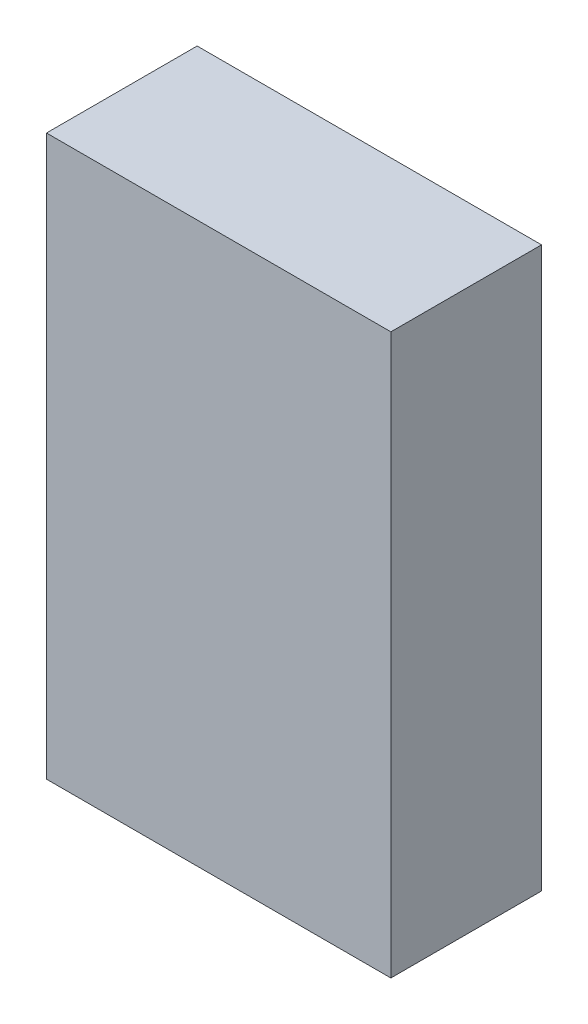
ISO-10303-21;
HEADER;
FILE_DESCRIPTION(('STEP AP214'),'2;1');
FILE_NAME('part.step','',(''),(''),'','','');
FILE_SCHEMA(('AUTOMOTIVE_DESIGN { 1 0 10303 214 1 1 1 1 }'));
ENDSEC;
DATA;
#1=APPLICATION_CONTEXT('core data for automotive mechanical design processes');
#2=APPLICATION_PROTOCOL_DEFINITION('international standard','automotive_design',2000,#1);
#3=PRODUCT_CONTEXT('',#1,'mechanical');
#4=PRODUCT('Part','Part','',(#3));
#5=PRODUCT_RELATED_PRODUCT_CATEGORY('part','',(#4));
#6=PRODUCT_DEFINITION_FORMATION('','',#4);
#7=PRODUCT_DEFINITION_CONTEXT('part definition',#1,'design');
#8=PRODUCT_DEFINITION('design','',#6,#7);
#9=PRODUCT_DEFINITION_SHAPE('','',#8);
#10=(LENGTH_UNIT() NAMED_UNIT(*) SI_UNIT(.MILLI.,.METRE.));
#11=(NAMED_UNIT(*) PLANE_ANGLE_UNIT() SI_UNIT($,.RADIAN.));
#12=(NAMED_UNIT(*) SI_UNIT($,.STERADIAN.) SOLID_ANGLE_UNIT());
#13=UNCERTAINTY_MEASURE_WITH_UNIT(LENGTH_MEASURE(1.E-05),#10,'distance_accuracy_value','');
#14=(GEOMETRIC_REPRESENTATION_CONTEXT(3) GLOBAL_UNCERTAINTY_ASSIGNED_CONTEXT((#13)) GLOBAL_UNIT_ASSIGNED_CONTEXT((#10,
#11,#12)) REPRESENTATION_CONTEXT('',''));
#15=CARTESIAN_POINT('',(0.,0.,0.));
#16=DIRECTION('',(0.,0.,1.));
#17=DIRECTION('',(1.,0.,0.));
#18=AXIS2_PLACEMENT_3D('',#15,#16,#17);
#19=CARTESIAN_POINT('',(0.,0.,0.));
#20=DIRECTION('',(0.,0.,-1.));
#21=DIRECTION('',(-1.,0.,0.));
#22=AXIS2_PLACEMENT_3D('',#19,#20,#21);
#23=PLANE('',#22);
#24=DIRECTION('',(0.,-1.,0.));
#25=VECTOR('',#24,1.);
#26=CARTESIAN_POINT('',(0.,0.,0.));
#27=LINE('',#26,#25);
#28=CARTESIAN_POINT('',(0.,26.,0.));
#29=VERTEX_POINT('',#28);
#30=CARTESIAN_POINT('',(0.,0.,0.));
#31=VERTEX_POINT('',#30);
#32=EDGE_CURVE('E104',#29,#31,#27,.T.);
#33=ORIENTED_EDGE('',*,*,#32,.F.);
#34=DIRECTION('',(-1.,0.,0.));
#35=VECTOR('',#34,1.);
#36=CARTESIAN_POINT('',(0.,26.,0.));
#37=LINE('',#36,#35);
#38=CARTESIAN_POINT('',(16.,26.,0.));
#39=VERTEX_POINT('',#38);
#40=EDGE_CURVE('E55',#39,#29,#37,.T.);
#41=ORIENTED_EDGE('',*,*,#40,.F.);
#42=DIRECTION('',(0.,1.,0.));
#43=VECTOR('',#42,1.);
#44=CARTESIAN_POINT('',(16.,0.,0.));
#45=LINE('',#44,#43);
#46=CARTESIAN_POINT('',(16.,0.,0.));
#47=VERTEX_POINT('',#46);
#48=EDGE_CURVE('E161',#47,#39,#45,.T.);
#49=ORIENTED_EDGE('',*,*,#48,.F.);
#50=DIRECTION('',(1.,0.,0.));
#51=VECTOR('',#50,1.);
#52=CARTESIAN_POINT('',(0.,0.,0.));
#53=LINE('',#52,#51);
#54=EDGE_CURVE('E159',#31,#47,#53,.T.);
#55=ORIENTED_EDGE('',*,*,#54,.F.);
#56=EDGE_LOOP('',(#33,#41,#49,#55));
#57=FACE_BOUND('',#56,.T.);
#58=DIRECTION('',(0.,1.,0.));
#59=VECTOR('',#58,1.);
#60=CARTESIAN_POINT('',(13.25,23.7906209274536,0.));
#61=LINE('',#60,#59);
#62=CARTESIAN_POINT('',(13.25,2.2093790725464,0.));
#63=VERTEX_POINT('',#62);
#64=CARTESIAN_POINT('',(13.25,23.7906209274536,0.));
#65=VERTEX_POINT('',#64);
#66=EDGE_CURVE('E132',#63,#65,#61,.T.);
#67=ORIENTED_EDGE('',*,*,#66,.T.);
#68=CARTESIAN_POINT('',(8.,13.,0.));
#69=DIRECTION('',(0.,0.,1.));
#70=DIRECTION('',(1.,0.,0.));
#71=AXIS2_PLACEMENT_3D('',#68,#69,#70);
#72=CIRCLE('',#71,12.);
#73=CARTESIAN_POINT('',(2.75,23.7906209274536,0.));
#74=VERTEX_POINT('',#73);
#75=EDGE_CURVE('E47',#65,#74,#72,.T.);
#76=ORIENTED_EDGE('',*,*,#75,.T.);
#77=DIRECTION('',(0.,-1.,0.));
#78=VECTOR('',#77,1.);
#79=CARTESIAN_POINT('',(2.75,23.7906209274536,0.));
#80=LINE('',#79,#78);
#81=CARTESIAN_POINT('',(2.75,2.20937907254641,0.));
#82=VERTEX_POINT('',#81);
#83=EDGE_CURVE('E143',#74,#82,#80,.T.);
#84=ORIENTED_EDGE('',*,*,#83,.T.);
#85=CARTESIAN_POINT('',(8.,13.,0.));
#86=DIRECTION('',(0.,0.,1.));
#87=DIRECTION('',(1.,0.,0.));
#88=AXIS2_PLACEMENT_3D('',#85,#86,#87);
#89=CIRCLE('',#88,12.);
#90=EDGE_CURVE('E146',#82,#63,#89,.T.);
#91=ORIENTED_EDGE('',*,*,#90,.T.);
#92=EDGE_LOOP('',(#67,#76,#84,#91));
#93=FACE_BOUND('',#92,.T.);
#94=ADVANCED_FACE('F32',(#57,#93),#23,.T.);
#95=CARTESIAN_POINT('',(0.,0.,3.5));
#96=DIRECTION('',(1.,0.,0.));
#97=DIRECTION('',(0.,0.,-1.));
#98=AXIS2_PLACEMENT_3D('',#95,#96,#97);
#99=PLANE('',#98);
#100=ORIENTED_EDGE('',*,*,#32,.T.);
#101=DIRECTION('',(0.,0.,-1.));
#102=VECTOR('',#101,1.);
#103=CARTESIAN_POINT('',(0.,0.,3.5));
#104=LINE('',#103,#102);
#105=CARTESIAN_POINT('',(0.,0.,7.));
#106=VERTEX_POINT('',#105);
#107=EDGE_CURVE('E11',#106,#31,#104,.T.);
#108=ORIENTED_EDGE('',*,*,#107,.F.);
#109=DIRECTION('',(0.,-1.,0.));
#110=VECTOR('',#109,1.);
#111=CARTESIAN_POINT('',(0.,26.,7.));
#112=LINE('',#111,#110);
#113=CARTESIAN_POINT('',(0.,26.,7.));
#114=VERTEX_POINT('',#113);
#115=EDGE_CURVE('E102',#114,#106,#112,.T.);
#116=ORIENTED_EDGE('',*,*,#115,.F.);
#117=DIRECTION('',(0.,0.,-1.));
#118=VECTOR('',#117,1.);
#119=CARTESIAN_POINT('',(0.,26.,3.5));
#120=LINE('',#119,#118);
#121=EDGE_CURVE('E164',#114,#29,#120,.T.);
#122=ORIENTED_EDGE('',*,*,#121,.T.);
#123=EDGE_LOOP('',(#100,#108,#116,#122));
#124=FACE_BOUND('',#123,.T.);
#125=ADVANCED_FACE('F34',(#124),#99,.F.);
#126=CARTESIAN_POINT('',(0.,0.,3.5));
#127=DIRECTION('',(0.,1.,0.));
#128=DIRECTION('',(-1.,0.,0.));
#129=AXIS2_PLACEMENT_3D('',#126,#127,#128);
#130=PLANE('',#129);
#131=ORIENTED_EDGE('',*,*,#54,.T.);
#132=DIRECTION('',(0.,0.,-1.));
#133=VECTOR('',#132,1.);
#134=CARTESIAN_POINT('',(16.,0.,3.5));
#135=LINE('',#134,#133);
#136=CARTESIAN_POINT('',(16.,0.,7.));
#137=VERTEX_POINT('',#136);
#138=EDGE_CURVE('E40',#137,#47,#135,.T.);
#139=ORIENTED_EDGE('',*,*,#138,.F.);
#140=DIRECTION('',(1.,0.,0.));
#141=VECTOR('',#140,1.);
#142=CARTESIAN_POINT('',(0.,0.,7.));
#143=LINE('',#142,#141);
#144=EDGE_CURVE('E107',#106,#137,#143,.T.);
#145=ORIENTED_EDGE('',*,*,#144,.F.);
#146=ORIENTED_EDGE('',*,*,#107,.T.);
#147=EDGE_LOOP('',(#131,#139,#145,#146));
#148=FACE_BOUND('',#147,.T.);
#149=ADVANCED_FACE('F108',(#148),#130,.F.);
#150=CARTESIAN_POINT('',(16.,0.,3.5));
#151=DIRECTION('',(-1.,0.,0.));
#152=DIRECTION('',(0.,0.,1.));
#153=AXIS2_PLACEMENT_3D('',#150,#151,#152);
#154=PLANE('',#153);
#155=ORIENTED_EDGE('',*,*,#48,.T.);
#156=DIRECTION('',(0.,0.,-1.));
#157=VECTOR('',#156,1.);
#158=CARTESIAN_POINT('',(16.,26.,3.5));
#159=LINE('',#158,#157);
#160=CARTESIAN_POINT('',(16.,26.,7.));
#161=VERTEX_POINT('',#160);
#162=EDGE_CURVE('E166',#161,#39,#159,.T.);
#163=ORIENTED_EDGE('',*,*,#162,.F.);
#164=DIRECTION('',(0.,1.,0.));
#165=VECTOR('',#164,1.);
#166=CARTESIAN_POINT('',(16.,26.,7.));
#167=LINE('',#166,#165);
#168=EDGE_CURVE('E113',#137,#161,#167,.T.);
#169=ORIENTED_EDGE('',*,*,#168,.F.);
#170=ORIENTED_EDGE('',*,*,#138,.T.);
#171=EDGE_LOOP('',(#155,#163,#169,#170));
#172=FACE_BOUND('',#171,.T.);
#173=ADVANCED_FACE('F169',(#172),#154,.F.);
#174=CARTESIAN_POINT('',(0.,26.,3.5));
#175=DIRECTION('',(0.,-1.,0.));
#176=DIRECTION('',(0.,0.,-1.));
#177=AXIS2_PLACEMENT_3D('',#174,#175,#176);
#178=PLANE('',#177);
#179=ORIENTED_EDGE('',*,*,#40,.T.);
#180=ORIENTED_EDGE('',*,*,#121,.F.);
#181=DIRECTION('',(-1.,0.,0.));
#182=VECTOR('',#181,1.);
#183=CARTESIAN_POINT('',(0.,26.,7.));
#184=LINE('',#183,#182);
#185=EDGE_CURVE('E118',#161,#114,#184,.T.);
#186=ORIENTED_EDGE('',*,*,#185,.F.);
#187=ORIENTED_EDGE('',*,*,#162,.T.);
#188=EDGE_LOOP('',(#179,#180,#186,#187));
#189=FACE_BOUND('',#188,.T.);
#190=ADVANCED_FACE('F206',(#189),#178,.F.);
#191=CARTESIAN_POINT('',(8.,13.,3.5));
#192=DIRECTION('',(0.,0.,-1.));
#193=DIRECTION('',(-1.,0.,0.));
#194=AXIS2_PLACEMENT_3D('',#191,#192,#193);
#195=CYLINDRICAL_SURFACE('',#194,12.);
#196=ORIENTED_EDGE('',*,*,#75,.F.);
#197=DIRECTION('',(0.,0.,-1.));
#198=VECTOR('',#197,1.);
#199=CARTESIAN_POINT('',(13.25,23.7906209274536,3.5));
#200=LINE('',#199,#198);
#201=CARTESIAN_POINT('',(13.25,23.7906209274536,3.5));
#202=VERTEX_POINT('',#201);
#203=EDGE_CURVE('E141',#202,#65,#200,.T.);
#204=ORIENTED_EDGE('',*,*,#203,.F.);
#205=CARTESIAN_POINT('',(8.,13.,3.5));
#206=DIRECTION('',(0.,0.,1.));
#207=DIRECTION('',(1.,0.,0.));
#208=AXIS2_PLACEMENT_3D('',#205,#206,#207);
#209=CIRCLE('',#208,12.);
#210=CARTESIAN_POINT('',(2.75,23.7906209274536,3.5));
#211=VERTEX_POINT('',#210);
#212=EDGE_CURVE('E128',#202,#211,#209,.T.);
#213=ORIENTED_EDGE('',*,*,#212,.T.);
#214=DIRECTION('',(0.,0.,-1.));
#215=VECTOR('',#214,1.);
#216=CARTESIAN_POINT('',(2.75,23.7906209274536,3.5));
#217=LINE('',#216,#215);
#218=EDGE_CURVE('E156',#211,#74,#217,.T.);
#219=ORIENTED_EDGE('',*,*,#218,.T.);
#220=EDGE_LOOP('',(#196,#204,#213,#219));
#221=FACE_BOUND('',#220,.T.);
#222=ADVANCED_FACE('F179',(#221),#195,.F.);
#223=CARTESIAN_POINT('',(2.75,23.7906209274536,3.5));
#224=DIRECTION('',(1.,0.,0.));
#225=DIRECTION('',(0.,0.,-1.));
#226=AXIS2_PLACEMENT_3D('',#223,#224,#225);
#227=PLANE('',#226);
#228=ORIENTED_EDGE('',*,*,#83,.F.);
#229=ORIENTED_EDGE('',*,*,#218,.F.);
#230=DIRECTION('',(0.,-1.,0.));
#231=VECTOR('',#230,1.);
#232=CARTESIAN_POINT('',(2.75,23.7906209274536,3.5));
#233=LINE('',#232,#231);
#234=CARTESIAN_POINT('',(2.75,2.20937907254641,3.5));
#235=VERTEX_POINT('',#234);
#236=EDGE_CURVE('E131',#211,#235,#233,.T.);
#237=ORIENTED_EDGE('',*,*,#236,.T.);
#238=DIRECTION('',(0.,0.,-1.));
#239=VECTOR('',#238,1.);
#240=CARTESIAN_POINT('',(2.75,2.20937907254641,3.5));
#241=LINE('',#240,#239);
#242=EDGE_CURVE('E154',#235,#82,#241,.T.);
#243=ORIENTED_EDGE('',*,*,#242,.T.);
#244=EDGE_LOOP('',(#228,#229,#237,#243));
#245=FACE_BOUND('',#244,.T.);
#246=ADVANCED_FACE('F183',(#245),#227,.T.);
#247=CARTESIAN_POINT('',(8.,13.,3.5));
#248=DIRECTION('',(0.,0.,-1.));
#249=DIRECTION('',(-1.,0.,0.));
#250=AXIS2_PLACEMENT_3D('',#247,#248,#249);
#251=CYLINDRICAL_SURFACE('',#250,12.);
#252=ORIENTED_EDGE('',*,*,#90,.F.);
#253=ORIENTED_EDGE('',*,*,#242,.F.);
#254=CARTESIAN_POINT('',(8.,13.,3.5));
#255=DIRECTION('',(0.,0.,1.));
#256=DIRECTION('',(1.,0.,0.));
#257=AXIS2_PLACEMENT_3D('',#254,#255,#256);
#258=CIRCLE('',#257,12.);
#259=CARTESIAN_POINT('',(13.25,2.2093790725464,3.5));
#260=VERTEX_POINT('',#259);
#261=EDGE_CURVE('E135',#235,#260,#258,.T.);
#262=ORIENTED_EDGE('',*,*,#261,.T.);
#263=DIRECTION('',(0.,0.,-1.));
#264=VECTOR('',#263,1.);
#265=CARTESIAN_POINT('',(13.25,2.2093790725464,3.5));
#266=LINE('',#265,#264);
#267=EDGE_CURVE('E152',#260,#63,#266,.T.);
#268=ORIENTED_EDGE('',*,*,#267,.T.);
#269=EDGE_LOOP('',(#252,#253,#262,#268));
#270=FACE_BOUND('',#269,.T.);
#271=ADVANCED_FACE('F186',(#270),#251,.F.);
#272=CARTESIAN_POINT('',(13.25,23.7906209274536,3.5));
#273=DIRECTION('',(-1.,0.,0.));
#274=DIRECTION('',(0.,0.,1.));
#275=AXIS2_PLACEMENT_3D('',#272,#273,#274);
#276=PLANE('',#275);
#277=ORIENTED_EDGE('',*,*,#66,.F.);
#278=ORIENTED_EDGE('',*,*,#267,.F.);
#279=DIRECTION('',(0.,1.,0.));
#280=VECTOR('',#279,1.);
#281=CARTESIAN_POINT('',(13.25,23.7906209274536,3.5));
#282=LINE('',#281,#280);
#283=EDGE_CURVE('E138',#260,#202,#282,.T.);
#284=ORIENTED_EDGE('',*,*,#283,.T.);
#285=ORIENTED_EDGE('',*,*,#203,.T.);
#286=EDGE_LOOP('',(#277,#278,#284,#285));
#287=FACE_BOUND('',#286,.T.);
#288=ADVANCED_FACE('F178',(#287),#276,.T.);
#289=CARTESIAN_POINT('',(0.,0.,3.5));
#290=DIRECTION('',(0.,0.,1.));
#291=DIRECTION('',(1.,0.,0.));
#292=AXIS2_PLACEMENT_3D('',#289,#290,#291);
#293=PLANE('',#292);
#294=CARTESIAN_POINT('',(8.,13.,3.5));
#295=DIRECTION('',(0.,0.,-1.));
#296=DIRECTION('',(-1.,0.,0.));
#297=AXIS2_PLACEMENT_3D('',#294,#295,#296);
#298=CIRCLE('',#297,5.);
#299=CARTESIAN_POINT('',(3.,13.,3.5));
#300=VERTEX_POINT('',#299);
#301=EDGE_CURVE('E122',#300,#300,#298,.T.);
#302=ORIENTED_EDGE('',*,*,#301,.F.);
#303=EDGE_LOOP('',(#302));
#304=FACE_BOUND('',#303,.T.);
#305=ORIENTED_EDGE('',*,*,#212,.F.);
#306=ORIENTED_EDGE('',*,*,#283,.F.);
#307=ORIENTED_EDGE('',*,*,#261,.F.);
#308=ORIENTED_EDGE('',*,*,#236,.F.);
#309=EDGE_LOOP('',(#305,#306,#307,#308));
#310=FACE_BOUND('',#309,.T.);
#311=ADVANCED_FACE('F187',(#304,#310),#293,.F.);
#312=CARTESIAN_POINT('',(0.,0.,7.));
#313=DIRECTION('',(0.,0.,1.));
#314=DIRECTION('',(1.,0.,0.));
#315=AXIS2_PLACEMENT_3D('',#312,#313,#314);
#316=PLANE('',#315);
#317=ORIENTED_EDGE('',*,*,#115,.T.);
#318=ORIENTED_EDGE('',*,*,#144,.T.);
#319=ORIENTED_EDGE('',*,*,#168,.T.);
#320=ORIENTED_EDGE('',*,*,#185,.T.);
#321=EDGE_LOOP('',(#317,#318,#319,#320));
#322=FACE_BOUND('',#321,.T.);
#323=ADVANCED_FACE('F116',(#322),#316,.T.);
#324=CARTESIAN_POINT('',(8.,13.,6.));
#325=DIRECTION('',(0.,0.,-1.));
#326=DIRECTION('',(-1.,0.,0.));
#327=AXIS2_PLACEMENT_3D('',#324,#325,#326);
#328=CYLINDRICAL_SURFACE('',#327,5.);
#329=CARTESIAN_POINT('',(8.,13.,6.));
#330=DIRECTION('',(0.,0.,-1.));
#331=DIRECTION('',(-1.,0.,0.));
#332=AXIS2_PLACEMENT_3D('',#329,#330,#331);
#333=CIRCLE('',#332,5.);
#334=CARTESIAN_POINT('',(3.,13.,6.));
#335=VERTEX_POINT('',#334);
#336=EDGE_CURVE('E119',#335,#335,#333,.T.);
#337=ORIENTED_EDGE('',*,*,#336,.F.);
#338=EDGE_LOOP('',(#337));
#339=FACE_BOUND('',#338,.T.);
#340=ORIENTED_EDGE('',*,*,#301,.T.);
#341=EDGE_LOOP('',(#340));
#342=FACE_BOUND('',#341,.T.);
#343=ADVANCED_FACE('F195',(#339,#342),#328,.F.);
#344=CARTESIAN_POINT('',(8.,13.,6.));
#345=DIRECTION('',(0.,0.,-1.));
#346=DIRECTION('',(-1.,0.,0.));
#347=AXIS2_PLACEMENT_3D('',#344,#345,#346);
#348=PLANE('',#347);
#349=ORIENTED_EDGE('',*,*,#336,.T.);
#350=EDGE_LOOP('',(#349));
#351=FACE_BOUND('',#350,.T.);
#352=ADVANCED_FACE('F286',(#351),#348,.T.);
#353=CLOSED_SHELL('',(#94,#125,#149,#173,#190,#222,#246,#271,#288,#311,#323,#343,#352));
#354=MANIFOLD_SOLID_BREP('B2',#353);
#355=ADVANCED_BREP_SHAPE_REPRESENTATION('',(#18,#354),#14);
#356=SHAPE_DEFINITION_REPRESENTATION(#9,#355);
ENDSEC;
END-ISO-10303-21;
